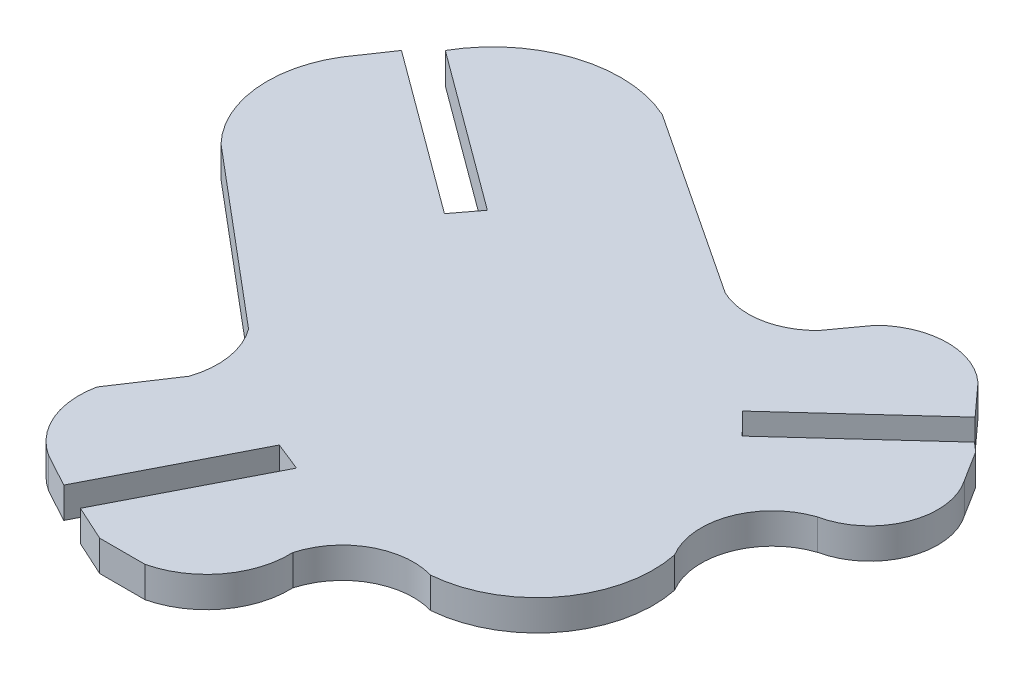
ISO-10303-21;
HEADER;
FILE_DESCRIPTION(('STEP AP214'),'2;1');
FILE_NAME('part.step','',(''),(''),'','','');
FILE_SCHEMA(('AUTOMOTIVE_DESIGN { 1 0 10303 214 1 1 1 1 }'));
ENDSEC;
DATA;
#1=APPLICATION_CONTEXT('core data for automotive mechanical design processes');
#2=APPLICATION_PROTOCOL_DEFINITION('international standard','automotive_design',2000,#1);
#3=PRODUCT_CONTEXT('',#1,'mechanical');
#4=PRODUCT('Part','Part','',(#3));
#5=PRODUCT_RELATED_PRODUCT_CATEGORY('part','',(#4));
#6=PRODUCT_DEFINITION_FORMATION('','',#4);
#7=PRODUCT_DEFINITION_CONTEXT('part definition',#1,'design');
#8=PRODUCT_DEFINITION('design','',#6,#7);
#9=PRODUCT_DEFINITION_SHAPE('','',#8);
#10=(LENGTH_UNIT() NAMED_UNIT(*) SI_UNIT(.MILLI.,.METRE.));
#11=(NAMED_UNIT(*) PLANE_ANGLE_UNIT() SI_UNIT($,.RADIAN.));
#12=(NAMED_UNIT(*) SI_UNIT($,.STERADIAN.) SOLID_ANGLE_UNIT());
#13=UNCERTAINTY_MEASURE_WITH_UNIT(LENGTH_MEASURE(1.E-05),#10,'distance_accuracy_value','');
#14=(GEOMETRIC_REPRESENTATION_CONTEXT(3) GLOBAL_UNCERTAINTY_ASSIGNED_CONTEXT((#13)) GLOBAL_UNIT_ASSIGNED_CONTEXT((#10,
#11,#12)) REPRESENTATION_CONTEXT('',''));
#15=CARTESIAN_POINT('',(0.,0.,0.));
#16=DIRECTION('',(0.,0.,1.));
#17=DIRECTION('',(1.,0.,0.));
#18=AXIS2_PLACEMENT_3D('',#15,#16,#17);
#19=CARTESIAN_POINT('',(-441.866925161714,2.,-699.134965113624));
#20=DIRECTION('',(-0.551707190438773,0.,0.834037874450649));
#21=DIRECTION('',(0.834037874450649,0.,0.551707190438773));
#22=AXIS2_PLACEMENT_3D('',#19,#20,#21);
#23=PLANE('',#22);
#24=DIRECTION('',(-0.834037874450649,0.,-0.551707190438773));
#25=VECTOR('',#24,1.);
#26=CARTESIAN_POINT('',(-441.866925161714,0.,-699.134965113624));
#27=LINE('',#26,#25);
#28=CARTESIAN_POINT('',(-307.015589999977,0.,-609.932239999967));
#29=VERTEX_POINT('',#28);
#30=CARTESIAN_POINT('',(-319.12552,0.,-617.94283));
#31=VERTEX_POINT('',#30);
#32=EDGE_CURVE('E11',#29,#31,#27,.T.);
#33=ORIENTED_EDGE('',*,*,#32,.T.);
#34=DIRECTION('',(0.,-1.,0.));
#35=VECTOR('',#34,1.);
#36=CARTESIAN_POINT('',(-319.12552,2.,-617.94283));
#37=LINE('',#36,#35);
#38=CARTESIAN_POINT('',(-319.12552,2.,-617.94283));
#39=VERTEX_POINT('',#38);
#40=EDGE_CURVE('E595',#39,#31,#37,.T.);
#41=ORIENTED_EDGE('',*,*,#40,.F.);
#42=DIRECTION('',(-0.834037874450649,0.,-0.551707190438773));
#43=VECTOR('',#42,1.);
#44=CARTESIAN_POINT('',(-441.866925161714,2.,-699.134965113624));
#45=LINE('',#44,#43);
#46=CARTESIAN_POINT('',(-307.015589999977,2.,-609.932239999967));
#47=VERTEX_POINT('',#46);
#48=EDGE_CURVE('E41',#47,#39,#45,.T.);
#49=ORIENTED_EDGE('',*,*,#48,.F.);
#50=DIRECTION('',(0.,-1.,0.));
#51=VECTOR('',#50,1.);
#52=CARTESIAN_POINT('',(-307.015589999977,2.,-609.932239999967));
#53=LINE('',#52,#51);
#54=EDGE_CURVE('E161',#47,#29,#53,.T.);
#55=ORIENTED_EDGE('',*,*,#54,.T.);
#56=EDGE_LOOP('',(#33,#41,#49,#55));
#57=FACE_BOUND('',#56,.T.);
#58=ADVANCED_FACE('F37',(#57),#23,.F.);
#59=CARTESIAN_POINT('',(-322.578964953298,2.,-610.341458400704));
#60=DIRECTION('',(0.,-1.,0.));
#61=DIRECTION('',(0.,0.,-1.));
#62=AXIS2_PLACEMENT_3D('',#59,#60,#61);
#63=CYLINDRICAL_SURFACE('',#62,8.34907972389994);
#64=CARTESIAN_POINT('',(-322.578964953298,0.,-610.341458400704));
#65=DIRECTION('',(0.,1.,0.));
#66=DIRECTION('',(0.,0.,1.));
#67=AXIS2_PLACEMENT_3D('',#64,#65,#66);
#68=CIRCLE('',#67,8.34907972389994);
#69=CARTESIAN_POINT('',(-329.825630000025,0.,-614.487900000025));
#70=VERTEX_POINT('',#69);
#71=EDGE_CURVE('E47',#31,#70,#68,.T.);
#72=ORIENTED_EDGE('',*,*,#71,.T.);
#73=DIRECTION('',(0.,-1.,0.));
#74=VECTOR('',#73,1.);
#75=CARTESIAN_POINT('',(-329.825630000025,2.,-614.487900000025));
#76=LINE('',#75,#74);
#77=CARTESIAN_POINT('',(-329.825630000025,2.,-614.487900000025));
#78=VERTEX_POINT('',#77);
#79=EDGE_CURVE('E252',#78,#70,#76,.T.);
#80=ORIENTED_EDGE('',*,*,#79,.F.);
#81=CARTESIAN_POINT('',(-322.578964953298,2.,-610.341458400704));
#82=DIRECTION('',(0.,1.,0.));
#83=DIRECTION('',(0.,0.,1.));
#84=AXIS2_PLACEMENT_3D('',#81,#82,#83);
#85=CIRCLE('',#84,8.34907972389994);
#86=EDGE_CURVE('E152',#39,#78,#85,.T.);
#87=ORIENTED_EDGE('',*,*,#86,.F.);
#88=ORIENTED_EDGE('',*,*,#40,.T.);
#89=EDGE_LOOP('',(#72,#80,#87,#88));
#90=FACE_BOUND('',#89,.T.);
#91=ADVANCED_FACE('F596',(#90),#63,.T.);
#92=CARTESIAN_POINT('',(-436.72929233314,2.,-693.204562793654));
#93=DIRECTION('',(0.592933151615653,0.,-0.805251685943674));
#94=DIRECTION('',(-0.805251685943674,0.,-0.592933151615653));
#95=AXIS2_PLACEMENT_3D('',#92,#93,#94);
#96=PLANE('',#95);
#97=DIRECTION('',(0.805251685943674,0.,0.592933151615653));
#98=VECTOR('',#97,1.);
#99=CARTESIAN_POINT('',(-436.72929233314,0.,-693.204562793654));
#100=LINE('',#99,#98);
#101=CARTESIAN_POINT('',(-319.42745,0.,-606.83138));
#102=VERTEX_POINT('',#101);
#103=EDGE_CURVE('E246',#70,#102,#100,.T.);
#104=ORIENTED_EDGE('',*,*,#103,.T.);
#105=DIRECTION('',(0.,-1.,0.));
#106=VECTOR('',#105,1.);
#107=CARTESIAN_POINT('',(-319.42745,2.,-606.83138));
#108=LINE('',#107,#106);
#109=CARTESIAN_POINT('',(-319.42745,2.,-606.83138));
#110=VERTEX_POINT('',#109);
#111=EDGE_CURVE('E250',#110,#102,#108,.T.);
#112=ORIENTED_EDGE('',*,*,#111,.F.);
#113=DIRECTION('',(0.805251685943674,0.,0.592933151615653));
#114=VECTOR('',#113,1.);
#115=CARTESIAN_POINT('',(-436.72929233314,2.,-693.204562793654));
#116=LINE('',#115,#114);
#117=EDGE_CURVE('E332',#78,#110,#116,.T.);
#118=ORIENTED_EDGE('',*,*,#117,.F.);
#119=ORIENTED_EDGE('',*,*,#79,.T.);
#120=EDGE_LOOP('',(#104,#112,#118,#119));
#121=FACE_BOUND('',#120,.T.);
#122=ADVANCED_FACE('F248',(#121),#96,.F.);
#123=CARTESIAN_POINT('',(-411.350594989002,2.,-485.431516552547));
#124=DIRECTION('',(0.797238944664529,0.,0.603663867653339));
#125=DIRECTION('',(0.603663867653339,0.,-0.797238944664529));
#126=AXIS2_PLACEMENT_3D('',#123,#124,#125);
#127=PLANE('',#126);
#128=DIRECTION('',(-0.603663867653339,0.,0.797238944664529));
#129=VECTOR('',#128,1.);
#130=CARTESIAN_POINT('',(-411.350594989002,0.,-485.431516552547));
#131=LINE('',#130,#129);
#132=CARTESIAN_POINT('',(-320.63406,0.,-605.23785));
#133=VERTEX_POINT('',#132);
#134=EDGE_CURVE('E254',#102,#133,#131,.T.);
#135=ORIENTED_EDGE('',*,*,#134,.T.);
#136=DIRECTION('',(0.,-1.,0.));
#137=VECTOR('',#136,1.);
#138=CARTESIAN_POINT('',(-320.63406,2.,-605.23785));
#139=LINE('',#138,#137);
#140=CARTESIAN_POINT('',(-320.63406,2.,-605.23785));
#141=VERTEX_POINT('',#140);
#142=EDGE_CURVE('E261',#141,#133,#139,.T.);
#143=ORIENTED_EDGE('',*,*,#142,.F.);
#144=DIRECTION('',(-0.603663867653339,0.,0.797238944664529));
#145=VECTOR('',#144,1.);
#146=CARTESIAN_POINT('',(-411.350594989002,2.,-485.431516552547));
#147=LINE('',#146,#145);
#148=EDGE_CURVE('E260',#110,#141,#147,.T.);
#149=ORIENTED_EDGE('',*,*,#148,.F.);
#150=ORIENTED_EDGE('',*,*,#111,.T.);
#151=EDGE_LOOP('',(#135,#143,#149,#150));
#152=FACE_BOUND('',#151,.T.);
#153=ADVANCED_FACE('F257',(#152),#127,.F.);
#154=CARTESIAN_POINT('',(-437.936085963276,2.,-691.592061368763));
#155=DIRECTION('',(-0.592848091817393,0.,0.805314311327246));
#156=DIRECTION('',(0.805314311327246,0.,0.592848091817393));
#157=AXIS2_PLACEMENT_3D('',#154,#155,#156);
#158=PLANE('',#157);
#159=DIRECTION('',(-0.805314311327245,0.,-0.592848091817393));
#160=VECTOR('',#159,1.);
#161=CARTESIAN_POINT('',(-437.936085963276,0.,-691.592061368763));
#162=LINE('',#161,#160);
#163=CARTESIAN_POINT('',(-331.25847,0.,-613.05922));
#164=VERTEX_POINT('',#163);
#165=EDGE_CURVE('E266',#133,#164,#162,.T.);
#166=ORIENTED_EDGE('',*,*,#165,.T.);
#167=DIRECTION('',(0.,-1.,0.));
#168=VECTOR('',#167,1.);
#169=CARTESIAN_POINT('',(-331.25847,2.,-613.05922));
#170=LINE('',#169,#168);
#171=CARTESIAN_POINT('',(-331.25847,2.,-613.05922));
#172=VERTEX_POINT('',#171);
#173=EDGE_CURVE('E406',#172,#164,#170,.T.);
#174=ORIENTED_EDGE('',*,*,#173,.F.);
#175=DIRECTION('',(-0.805314311327245,0.,-0.592848091817393));
#176=VECTOR('',#175,1.);
#177=CARTESIAN_POINT('',(-437.936085963276,2.,-691.592061368763));
#178=LINE('',#177,#176);
#179=EDGE_CURVE('E329',#141,#172,#178,.T.);
#180=ORIENTED_EDGE('',*,*,#179,.F.);
#181=ORIENTED_EDGE('',*,*,#142,.T.);
#182=EDGE_LOOP('',(#166,#174,#180,#181));
#183=FACE_BOUND('',#182,.T.);
#184=ADVANCED_FACE('F591',(#183),#158,.F.);
#185=CARTESIAN_POINT('',(-411.861982888249,2.,-494.581890618209));
#186=DIRECTION('',(0.826800158835259,0.,0.56249577540635));
#187=DIRECTION('',(0.56249577540635,0.,-0.826800158835259));
#188=AXIS2_PLACEMENT_3D('',#185,#186,#187);
#189=PLANE('',#188);
#190=DIRECTION('',(-0.56249577540635,0.,0.826800158835259));
#191=VECTOR('',#190,1.);
#192=CARTESIAN_POINT('',(-411.861982888249,0.,-494.581890618209));
#193=LINE('',#192,#191);
#194=CARTESIAN_POINT('',(-332.83373,0.,-610.74378));
#195=VERTEX_POINT('',#194);
#196=EDGE_CURVE('E268',#164,#195,#193,.T.);
#197=ORIENTED_EDGE('',*,*,#196,.T.);
#198=DIRECTION('',(0.,-1.,0.));
#199=VECTOR('',#198,1.);
#200=CARTESIAN_POINT('',(-332.83373,2.,-610.74378));
#201=LINE('',#200,#199);
#202=CARTESIAN_POINT('',(-332.83373,2.,-610.74378));
#203=VERTEX_POINT('',#202);
#204=EDGE_CURVE('E403',#203,#195,#201,.T.);
#205=ORIENTED_EDGE('',*,*,#204,.F.);
#206=DIRECTION('',(-0.56249577540635,0.,0.826800158835259));
#207=VECTOR('',#206,1.);
#208=CARTESIAN_POINT('',(-411.861982888249,2.,-494.581890618209));
#209=LINE('',#208,#207);
#210=EDGE_CURVE('E327',#172,#203,#209,.T.);
#211=ORIENTED_EDGE('',*,*,#210,.F.);
#212=ORIENTED_EDGE('',*,*,#173,.T.);
#213=EDGE_LOOP('',(#197,#205,#211,#212));
#214=FACE_BOUND('',#213,.T.);
#215=ADVANCED_FACE('F401',(#214),#189,.F.);
#216=CARTESIAN_POINT('',(-326.616839447435,2.,-606.943354947336));
#217=DIRECTION('',(0.,-1.,0.));
#218=DIRECTION('',(0.,0.,-1.));
#219=AXIS2_PLACEMENT_3D('',#216,#217,#218);
#220=CYLINDRICAL_SURFACE('',#219,7.28649152360002);
#221=CARTESIAN_POINT('',(-326.616839447435,0.,-606.943354947336));
#222=DIRECTION('',(0.,1.,0.));
#223=DIRECTION('',(0.,0.,1.));
#224=AXIS2_PLACEMENT_3D('',#221,#222,#223);
#225=CIRCLE('',#224,7.28649152360002);
#226=CARTESIAN_POINT('',(-331.865339999968,0.,-601.889029999972));
#227=VERTEX_POINT('',#226);
#228=EDGE_CURVE('E396',#195,#227,#225,.T.);
#229=ORIENTED_EDGE('',*,*,#228,.T.);
#230=DIRECTION('',(0.,-1.,0.));
#231=VECTOR('',#230,1.);
#232=CARTESIAN_POINT('',(-331.865339999968,2.,-601.889029999972));
#233=LINE('',#232,#231);
#234=CARTESIAN_POINT('',(-331.865339999968,2.,-601.889029999972));
#235=VERTEX_POINT('',#234);
#236=EDGE_CURVE('E412',#235,#227,#233,.T.);
#237=ORIENTED_EDGE('',*,*,#236,.F.);
#238=CARTESIAN_POINT('',(-326.616839447435,2.,-606.943354947336));
#239=DIRECTION('',(0.,1.,0.));
#240=DIRECTION('',(0.,0.,1.));
#241=AXIS2_PLACEMENT_3D('',#238,#239,#240);
#242=CIRCLE('',#241,7.28649152360002);
#243=EDGE_CURVE('E325',#203,#235,#242,.T.);
#244=ORIENTED_EDGE('',*,*,#243,.F.);
#245=ORIENTED_EDGE('',*,*,#204,.T.);
#246=EDGE_LOOP('',(#229,#237,#244,#245));
#247=FACE_BOUND('',#246,.T.);
#248=ADVANCED_FACE('F409',(#247),#220,.T.);
#249=CARTESIAN_POINT('',(-430.763131321581,2.,-685.134155832371));
#250=DIRECTION('',(0.643967246088412,0.,-0.765053060882254));
#251=DIRECTION('',(-0.765053060882254,0.,-0.643967246088412));
#252=AXIS2_PLACEMENT_3D('',#249,#250,#251);
#253=PLANE('',#252);
#254=DIRECTION('',(0.765053060882254,0.,0.643967246088412));
#255=VECTOR('',#254,1.);
#256=CARTESIAN_POINT('',(-430.763131321581,0.,-685.134155832371));
#257=LINE('',#256,#255);
#258=CARTESIAN_POINT('',(-320.50553,0.,-592.32715));
#259=VERTEX_POINT('',#258);
#260=EDGE_CURVE('E393',#227,#259,#257,.T.);
#261=ORIENTED_EDGE('',*,*,#260,.T.);
#262=DIRECTION('',(0.,-1.,0.));
#263=VECTOR('',#262,1.);
#264=CARTESIAN_POINT('',(-320.50553,2.,-592.32715));
#265=LINE('',#264,#263);
#266=CARTESIAN_POINT('',(-320.50553,2.,-592.32715));
#267=VERTEX_POINT('',#266);
#268=EDGE_CURVE('E421',#267,#259,#265,.T.);
#269=ORIENTED_EDGE('',*,*,#268,.F.);
#270=DIRECTION('',(0.765053060882254,0.,0.643967246088412));
#271=VECTOR('',#270,1.);
#272=CARTESIAN_POINT('',(-430.763131321581,2.,-685.134155832371));
#273=LINE('',#272,#271);
#274=EDGE_CURVE('E323',#235,#267,#273,.T.);
#275=ORIENTED_EDGE('',*,*,#274,.F.);
#276=ORIENTED_EDGE('',*,*,#236,.T.);
#277=EDGE_LOOP('',(#261,#269,#275,#276));
#278=FACE_BOUND('',#277,.T.);
#279=ADVANCED_FACE('F419',(#278),#253,.F.);
#280=CARTESIAN_POINT('',(-324.575550778408,2.,-589.322034891094));
#281=DIRECTION('',(0.,-1.,0.));
#282=DIRECTION('',(0.,0.,-1.));
#283=AXIS2_PLACEMENT_3D('',#280,#281,#282);
#284=CYLINDRICAL_SURFACE('',#283,5.05922780218982);
#285=CARTESIAN_POINT('',(-324.575550778408,0.,-589.322034891094));
#286=DIRECTION('',(0.,1.,0.));
#287=DIRECTION('',(0.,0.,1.));
#288=AXIS2_PLACEMENT_3D('',#285,#286,#287);
#289=CIRCLE('',#288,5.05922780218982);
#290=CARTESIAN_POINT('',(-319.773699999986,0.,-587.728920000001));
#291=VERTEX_POINT('',#290);
#292=EDGE_CURVE('E390',#291,#259,#289,.T.);
#293=ORIENTED_EDGE('',*,*,#292,.F.);
#294=DIRECTION('',(0.,-1.,0.));
#295=VECTOR('',#294,1.);
#296=CARTESIAN_POINT('',(-319.773699999986,2.,-587.728920000001));
#297=LINE('',#296,#295);
#298=CARTESIAN_POINT('',(-319.773699999986,2.,-587.728920000001));
#299=VERTEX_POINT('',#298);
#300=EDGE_CURVE('E423',#299,#291,#297,.T.);
#301=ORIENTED_EDGE('',*,*,#300,.F.);
#302=CARTESIAN_POINT('',(-324.575550778408,2.,-589.322034891094));
#303=DIRECTION('',(0.,1.,0.));
#304=DIRECTION('',(0.,0.,1.));
#305=AXIS2_PLACEMENT_3D('',#302,#303,#304);
#306=CIRCLE('',#305,5.05922780218982);
#307=EDGE_CURVE('E320',#299,#267,#306,.T.);
#308=ORIENTED_EDGE('',*,*,#307,.T.);
#309=ORIENTED_EDGE('',*,*,#268,.T.);
#310=EDGE_LOOP('',(#293,#301,#308,#309));
#311=FACE_BOUND('',#310,.T.);
#312=ADVANCED_FACE('F588',(#311),#284,.F.);
#313=CARTESIAN_POINT('',(-389.962390495414,2.,-481.95781333404));
#314=DIRECTION('',(0.833231438575736,0.,0.552924379792581));
#315=DIRECTION('',(0.552924379792581,0.,-0.833231438575736));
#316=AXIS2_PLACEMENT_3D('',#313,#314,#315);
#317=PLANE('',#316);
#318=DIRECTION('',(-0.552924379792581,0.,0.833231438575736));
#319=VECTOR('',#318,1.);
#320=CARTESIAN_POINT('',(-389.962390495414,0.,-481.95781333404));
#321=LINE('',#320,#319);
#322=CARTESIAN_POINT('',(-322.175300000018,0.,-584.109819999997));
#323=VERTEX_POINT('',#322);
#324=EDGE_CURVE('E388',#291,#323,#321,.T.);
#325=ORIENTED_EDGE('',*,*,#324,.T.);
#326=DIRECTION('',(0.,-1.,0.));
#327=VECTOR('',#326,1.);
#328=CARTESIAN_POINT('',(-322.175300000018,2.,-584.109819999997));
#329=LINE('',#328,#327);
#330=CARTESIAN_POINT('',(-322.175300000018,2.,-584.109819999997));
#331=VERTEX_POINT('',#330);
#332=EDGE_CURVE('E428',#331,#323,#329,.T.);
#333=ORIENTED_EDGE('',*,*,#332,.F.);
#334=DIRECTION('',(-0.552924379792581,0.,0.833231438575736));
#335=VECTOR('',#334,1.);
#336=CARTESIAN_POINT('',(-389.962390495414,2.,-481.95781333404));
#337=LINE('',#336,#335);
#338=EDGE_CURVE('E318',#299,#331,#337,.T.);
#339=ORIENTED_EDGE('',*,*,#338,.F.);
#340=ORIENTED_EDGE('',*,*,#300,.T.);
#341=EDGE_LOOP('',(#325,#333,#339,#340));
#342=FACE_BOUND('',#341,.T.);
#343=ADVANCED_FACE('F585',(#342),#317,.F.);
#344=CARTESIAN_POINT('',(-317.084902312706,2.,-583.043285507489));
#345=DIRECTION('',(0.,-1.,0.));
#346=DIRECTION('',(0.,0.,-1.));
#347=AXIS2_PLACEMENT_3D('',#344,#345,#346);
#348=CYLINDRICAL_SURFACE('',#347,5.20092726719996);
#349=CARTESIAN_POINT('',(-317.084902312706,0.,-583.043285507489));
#350=DIRECTION('',(0.,1.,0.));
#351=DIRECTION('',(0.,0.,1.));
#352=AXIS2_PLACEMENT_3D('',#349,#350,#351);
#353=CIRCLE('',#352,5.20092726719996);
#354=CARTESIAN_POINT('',(-319.88782000005,0.,-578.662270000021));
#355=VERTEX_POINT('',#354);
#356=EDGE_CURVE('E386',#323,#355,#353,.T.);
#357=ORIENTED_EDGE('',*,*,#356,.T.);
#358=DIRECTION('',(0.,-1.,0.));
#359=VECTOR('',#358,1.);
#360=CARTESIAN_POINT('',(-319.88782000005,2.,-578.662270000021));
#361=LINE('',#360,#359);
#362=CARTESIAN_POINT('',(-319.88782000005,2.,-578.662270000021));
#363=VERTEX_POINT('',#362);
#364=EDGE_CURVE('E431',#363,#355,#361,.T.);
#365=ORIENTED_EDGE('',*,*,#364,.F.);
#366=CARTESIAN_POINT('',(-317.084902312706,2.,-583.043285507489));
#367=DIRECTION('',(0.,1.,0.));
#368=DIRECTION('',(0.,0.,1.));
#369=AXIS2_PLACEMENT_3D('',#366,#367,#368);
#370=CIRCLE('',#369,5.20092726719996);
#371=EDGE_CURVE('E316',#331,#363,#370,.T.);
#372=ORIENTED_EDGE('',*,*,#371,.F.);
#373=ORIENTED_EDGE('',*,*,#332,.T.);
#374=EDGE_LOOP('',(#357,#365,#372,#373));
#375=FACE_BOUND('',#374,.T.);
#376=ADVANCED_FACE('F580',(#375),#348,.T.);
#377=CARTESIAN_POINT('',(-476.176437380374,2.,-663.591368676976));
#378=DIRECTION('',(0.47746832523969,0.,-0.878648961982432));
#379=DIRECTION('',(-0.878648961982432,0.,-0.47746832523969));
#380=AXIS2_PLACEMENT_3D('',#377,#378,#379);
#381=PLANE('',#380);
#382=DIRECTION('',(0.878648961982432,0.,0.47746832523969));
#383=VECTOR('',#382,1.);
#384=CARTESIAN_POINT('',(-476.176437380374,0.,-663.591368676976));
#385=LINE('',#384,#383);
#386=CARTESIAN_POINT('',(-317.715030000018,0.,-577.481549999997));
#387=VERTEX_POINT('',#386);
#388=EDGE_CURVE('E384',#355,#387,#385,.T.);
#389=ORIENTED_EDGE('',*,*,#388,.T.);
#390=DIRECTION('',(0.,-1.,0.));
#391=VECTOR('',#390,1.);
#392=CARTESIAN_POINT('',(-317.715030000018,2.,-577.481549999997));
#393=LINE('',#392,#391);
#394=CARTESIAN_POINT('',(-317.715030000018,2.,-577.481549999997));
#395=VERTEX_POINT('',#394);
#396=EDGE_CURVE('E434',#395,#387,#393,.T.);
#397=ORIENTED_EDGE('',*,*,#396,.F.);
#398=DIRECTION('',(0.878648961982432,0.,0.47746832523969));
#399=VECTOR('',#398,1.);
#400=CARTESIAN_POINT('',(-476.176437380374,2.,-663.591368676976));
#401=LINE('',#400,#399);
#402=EDGE_CURVE('E314',#363,#395,#401,.T.);
#403=ORIENTED_EDGE('',*,*,#402,.F.);
#404=ORIENTED_EDGE('',*,*,#364,.T.);
#405=EDGE_LOOP('',(#389,#397,#403,#404));
#406=FACE_BOUND('',#405,.T.);
#407=ADVANCED_FACE('F576',(#406),#381,.F.);
#408=CARTESIAN_POINT('',(-363.199913987513,2.,-488.754157968088));
#409=DIRECTION('',(-0.889884006191832,0.,-0.456186864699079));
#410=DIRECTION('',(-0.456186864699079,0.,0.889884006191832));
#411=AXIS2_PLACEMENT_3D('',#408,#409,#410);
#412=PLANE('',#411);
#413=DIRECTION('',(0.456186864699079,0.,-0.889884006191832));
#414=VECTOR('',#413,1.);
#415=CARTESIAN_POINT('',(-363.199913987513,0.,-488.754157968088));
#416=LINE('',#415,#414);
#417=CARTESIAN_POINT('',(-312.950060000018,0.,-586.776579999997));
#418=VERTEX_POINT('',#417);
#419=EDGE_CURVE('E382',#387,#418,#416,.T.);
#420=ORIENTED_EDGE('',*,*,#419,.T.);
#421=DIRECTION('',(0.,-1.,0.));
#422=VECTOR('',#421,1.);
#423=CARTESIAN_POINT('',(-312.950060000018,2.,-586.776579999997));
#424=LINE('',#423,#422);
#425=CARTESIAN_POINT('',(-312.950060000018,2.,-586.776579999997));
#426=VERTEX_POINT('',#425);
#427=EDGE_CURVE('E437',#426,#418,#424,.T.);
#428=ORIENTED_EDGE('',*,*,#427,.F.);
#429=DIRECTION('',(0.456186864699079,0.,-0.889884006191832));
#430=VECTOR('',#429,1.);
#431=CARTESIAN_POINT('',(-363.199913987513,2.,-488.754157968088));
#432=LINE('',#431,#430);
#433=EDGE_CURVE('E312',#395,#426,#432,.T.);
#434=ORIENTED_EDGE('',*,*,#433,.F.);
#435=ORIENTED_EDGE('',*,*,#396,.T.);
#436=EDGE_LOOP('',(#420,#428,#434,#435));
#437=FACE_BOUND('',#436,.T.);
#438=ADVANCED_FACE('F572',(#437),#412,.F.);
#439=CARTESIAN_POINT('',(-491.660908971243,2.,-657.990878278847));
#440=DIRECTION('',(0.370180269224135,0.,-0.928959939005524));
#441=DIRECTION('',(-0.928959939005524,0.,-0.370180269224135));
#442=AXIS2_PLACEMENT_3D('',#439,#440,#441);
#443=PLANE('',#442);
#444=DIRECTION('',(0.928959939005524,0.,0.370180269224135));
#445=VECTOR('',#444,1.);
#446=CARTESIAN_POINT('',(-491.660908971243,0.,-657.990878278847));
#447=LINE('',#446,#445);
#448=CARTESIAN_POINT('',(-311.083810000018,0.,-586.032899999997));
#449=VERTEX_POINT('',#448);
#450=EDGE_CURVE('E380',#418,#449,#447,.T.);
#451=ORIENTED_EDGE('',*,*,#450,.T.);
#452=DIRECTION('',(0.,-1.,0.));
#453=VECTOR('',#452,1.);
#454=CARTESIAN_POINT('',(-311.083810000018,2.,-586.032899999997));
#455=LINE('',#454,#453);
#456=CARTESIAN_POINT('',(-311.083810000018,2.,-586.032899999997));
#457=VERTEX_POINT('',#456);
#458=EDGE_CURVE('E440',#457,#449,#455,.T.);
#459=ORIENTED_EDGE('',*,*,#458,.F.);
#460=DIRECTION('',(0.928959939005524,0.,0.370180269224135));
#461=VECTOR('',#460,1.);
#462=CARTESIAN_POINT('',(-491.660908971243,2.,-657.990878278847));
#463=LINE('',#462,#461);
#464=EDGE_CURVE('E310',#426,#457,#463,.T.);
#465=ORIENTED_EDGE('',*,*,#464,.F.);
#466=ORIENTED_EDGE('',*,*,#427,.T.);
#467=EDGE_LOOP('',(#451,#459,#465,#466));
#468=FACE_BOUND('',#467,.T.);
#469=ADVANCED_FACE('F567',(#468),#443,.F.);
#470=CARTESIAN_POINT('',(-361.420151825822,2.,-487.841777467339));
#471=DIRECTION('',(0.889883984728387,0.,0.456186906567833));
#472=DIRECTION('',(0.456186906567833,0.,-0.889883984728387));
#473=AXIS2_PLACEMENT_3D('',#470,#471,#472);
#474=PLANE('',#473);
#475=DIRECTION('',(-0.456186906567833,0.,0.889883984728387));
#476=VECTOR('',#475,1.);
#477=CARTESIAN_POINT('',(-361.420151825822,0.,-487.841777467339));
#478=LINE('',#477,#476);
#479=CARTESIAN_POINT('',(-315.861740000018,0.,-576.712589999997));
#480=VERTEX_POINT('',#479);
#481=EDGE_CURVE('E378',#449,#480,#478,.T.);
#482=ORIENTED_EDGE('',*,*,#481,.T.);
#483=DIRECTION('',(0.,-1.,0.));
#484=VECTOR('',#483,1.);
#485=CARTESIAN_POINT('',(-315.861740000018,2.,-576.712589999997));
#486=LINE('',#485,#484);
#487=CARTESIAN_POINT('',(-315.861740000018,2.,-576.712589999997));
#488=VERTEX_POINT('',#487);
#489=EDGE_CURVE('E443',#488,#480,#486,.T.);
#490=ORIENTED_EDGE('',*,*,#489,.F.);
#491=DIRECTION('',(-0.456186906567833,0.,0.889883984728387));
#492=VECTOR('',#491,1.);
#493=CARTESIAN_POINT('',(-361.420151825822,2.,-487.841777467339));
#494=LINE('',#493,#492);
#495=EDGE_CURVE('E308',#457,#488,#494,.T.);
#496=ORIENTED_EDGE('',*,*,#495,.F.);
#497=ORIENTED_EDGE('',*,*,#458,.T.);
#498=EDGE_LOOP('',(#482,#490,#496,#497));
#499=FACE_BOUND('',#498,.T.);
#500=ADVANCED_FACE('F561',(#499),#474,.F.);
#501=CARTESIAN_POINT('',(-487.796944004701,2.,-655.368474344228));
#502=DIRECTION('',(0.416008815927201,0.,-0.909360580337001));
#503=DIRECTION('',(-0.909360580337001,0.,-0.416008815927201));
#504=AXIS2_PLACEMENT_3D('',#501,#502,#503);
#505=PLANE('',#504);
#506=DIRECTION('',(0.909360580337001,0.,0.416008815927201));
#507=VECTOR('',#506,1.);
#508=CARTESIAN_POINT('',(-487.796944004701,0.,-655.368474344228));
#509=LINE('',#508,#507);
#510=CARTESIAN_POINT('',(-313.545040000018,0.,-575.652759999997));
#511=VERTEX_POINT('',#510);
#512=EDGE_CURVE('E376',#480,#511,#509,.T.);
#513=ORIENTED_EDGE('',*,*,#512,.T.);
#514=DIRECTION('',(0.,-1.,0.));
#515=VECTOR('',#514,1.);
#516=CARTESIAN_POINT('',(-313.545040000018,2.,-575.652759999997));
#517=LINE('',#516,#515);
#518=CARTESIAN_POINT('',(-313.545040000018,2.,-575.652759999997));
#519=VERTEX_POINT('',#518);
#520=EDGE_CURVE('E446',#519,#511,#517,.T.);
#521=ORIENTED_EDGE('',*,*,#520,.F.);
#522=DIRECTION('',(0.909360580337001,0.,0.416008815927201));
#523=VECTOR('',#522,1.);
#524=CARTESIAN_POINT('',(-487.796944004701,2.,-655.368474344228));
#525=LINE('',#524,#523);
#526=EDGE_CURVE('E306',#488,#519,#525,.T.);
#527=ORIENTED_EDGE('',*,*,#526,.F.);
#528=ORIENTED_EDGE('',*,*,#489,.T.);
#529=EDGE_LOOP('',(#513,#521,#527,#528));
#530=FACE_BOUND('',#529,.T.);
#531=ADVANCED_FACE('F557',(#530),#505,.F.);
#532=CARTESIAN_POINT('',(-525.869702128861,2.,-575.652759999997));
#533=DIRECTION('',(0.,0.,-1.));
#534=DIRECTION('',(-1.,0.,0.));
#535=AXIS2_PLACEMENT_3D('',#532,#533,#534);
#536=PLANE('',#535);
#537=DIRECTION('',(1.,0.,0.));
#538=VECTOR('',#537,1.);
#539=CARTESIAN_POINT('',(-525.869702128861,0.,-575.652759999997));
#540=LINE('',#539,#538);
#541=CARTESIAN_POINT('',(-310.586690000018,0.,-575.652759999997));
#542=VERTEX_POINT('',#541);
#543=EDGE_CURVE('E374',#511,#542,#540,.T.);
#544=ORIENTED_EDGE('',*,*,#543,.T.);
#545=DIRECTION('',(0.,-1.,0.));
#546=VECTOR('',#545,1.);
#547=CARTESIAN_POINT('',(-310.586690000018,2.,-575.652759999997));
#548=LINE('',#547,#546);
#549=CARTESIAN_POINT('',(-310.586690000018,2.,-575.652759999997));
#550=VERTEX_POINT('',#549);
#551=EDGE_CURVE('E449',#550,#542,#548,.T.);
#552=ORIENTED_EDGE('',*,*,#551,.F.);
#553=DIRECTION('',(1.,0.,0.));
#554=VECTOR('',#553,1.);
#555=CARTESIAN_POINT('',(-525.869702128861,2.,-575.652759999997));
#556=LINE('',#555,#554);
#557=EDGE_CURVE('E304',#519,#550,#556,.T.);
#558=ORIENTED_EDGE('',*,*,#557,.F.);
#559=ORIENTED_EDGE('',*,*,#520,.T.);
#560=EDGE_LOOP('',(#544,#552,#558,#559));
#561=FACE_BOUND('',#560,.T.);
#562=ADVANCED_FACE('F552',(#561),#536,.F.);
#563=CARTESIAN_POINT('',(-311.838073974816,2.,-580.916994752258));
#564=DIRECTION('',(0.,-1.,0.));
#565=DIRECTION('',(0.,0.,-1.));
#566=AXIS2_PLACEMENT_3D('',#563,#564,#565);
#567=CYLINDRICAL_SURFACE('',#566,5.41092685029998);
#568=CARTESIAN_POINT('',(-311.838073974816,0.,-580.916994752258));
#569=DIRECTION('',(0.,1.,0.));
#570=DIRECTION('',(0.,0.,1.));
#571=AXIS2_PLACEMENT_3D('',#568,#569,#570);
#572=CIRCLE('',#571,5.41092685029998);
#573=CARTESIAN_POINT('',(-306.431680000054,0.,-581.138430000018));
#574=VERTEX_POINT('',#573);
#575=EDGE_CURVE('E371',#542,#574,#572,.T.);
#576=ORIENTED_EDGE('',*,*,#575,.T.);
#577=DIRECTION('',(0.,-1.,0.));
#578=VECTOR('',#577,1.);
#579=CARTESIAN_POINT('',(-306.431680000054,2.,-581.138430000018));
#580=LINE('',#579,#578);
#581=CARTESIAN_POINT('',(-306.431680000054,2.,-581.138430000018));
#582=VERTEX_POINT('',#581);
#583=EDGE_CURVE('E452',#582,#574,#580,.T.);
#584=ORIENTED_EDGE('',*,*,#583,.F.);
#585=CARTESIAN_POINT('',(-311.838073974816,2.,-580.916994752258));
#586=DIRECTION('',(0.,1.,0.));
#587=DIRECTION('',(0.,0.,1.));
#588=AXIS2_PLACEMENT_3D('',#585,#586,#587);
#589=CIRCLE('',#588,5.41092685029998);
#590=EDGE_CURVE('E302',#550,#582,#589,.T.);
#591=ORIENTED_EDGE('',*,*,#590,.F.);
#592=ORIENTED_EDGE('',*,*,#551,.T.);
#593=EDGE_LOOP('',(#576,#584,#591,#592));
#594=FACE_BOUND('',#593,.T.);
#595=ADVANCED_FACE('F546',(#594),#567,.T.);
#596=CARTESIAN_POINT('',(-301.955456241006,2.,-579.898386512494));
#597=DIRECTION('',(0.,-1.,0.));
#598=DIRECTION('',(0.,0.,-1.));
#599=AXIS2_PLACEMENT_3D('',#596,#597,#598);
#600=CYLINDRICAL_SURFACE('',#599,4.64481291248777);
#601=CARTESIAN_POINT('',(-301.955456241006,0.,-579.898386512494));
#602=DIRECTION('',(0.,1.,0.));
#603=DIRECTION('',(0.,0.,1.));
#604=AXIS2_PLACEMENT_3D('',#601,#602,#603);
#605=CIRCLE('',#604,4.64481291248777);
#606=CARTESIAN_POINT('',(-300.665630000047,0.,-584.36051999998));
#607=VERTEX_POINT('',#606);
#608=EDGE_CURVE('E368',#607,#574,#605,.T.);
#609=ORIENTED_EDGE('',*,*,#608,.F.);
#610=DIRECTION('',(0.,-1.,0.));
#611=VECTOR('',#610,1.);
#612=CARTESIAN_POINT('',(-300.665630000047,2.,-584.36051999998));
#613=LINE('',#612,#611);
#614=CARTESIAN_POINT('',(-300.665630000047,2.,-584.36051999998));
#615=VERTEX_POINT('',#614);
#616=EDGE_CURVE('E454',#615,#607,#613,.T.);
#617=ORIENTED_EDGE('',*,*,#616,.F.);
#618=CARTESIAN_POINT('',(-301.955456241006,2.,-579.898386512494));
#619=DIRECTION('',(0.,1.,0.));
#620=DIRECTION('',(0.,0.,1.));
#621=AXIS2_PLACEMENT_3D('',#618,#619,#620);
#622=CIRCLE('',#621,4.64481291248777);
#623=EDGE_CURVE('E299',#615,#582,#622,.T.);
#624=ORIENTED_EDGE('',*,*,#623,.T.);
#625=ORIENTED_EDGE('',*,*,#583,.T.);
#626=EDGE_LOOP('',(#609,#617,#624,#625));
#627=FACE_BOUND('',#626,.T.);
#628=ADVANCED_FACE('F540',(#627),#600,.F.);
#629=CARTESIAN_POINT('',(-301.279080957897,2.,-591.929168721821));
#630=DIRECTION('',(0.,-1.,0.));
#631=DIRECTION('',(0.,0.,-1.));
#632=AXIS2_PLACEMENT_3D('',#629,#630,#631);
#633=CYLINDRICAL_SURFACE('',#632,7.59346861139997);
#634=CARTESIAN_POINT('',(-301.279080957897,0.,-591.929168721821));
#635=DIRECTION('',(0.,1.,0.));
#636=DIRECTION('',(0.,0.,1.));
#637=AXIS2_PLACEMENT_3D('',#634,#635,#636);
#638=CIRCLE('',#637,7.59346861139997);
#639=CARTESIAN_POINT('',(-293.842540000045,0.,-593.464950000033));
#640=VERTEX_POINT('',#639);
#641=EDGE_CURVE('E365',#607,#640,#638,.T.);
#642=ORIENTED_EDGE('',*,*,#641,.T.);
#643=DIRECTION('',(0.,-1.,0.));
#644=VECTOR('',#643,1.);
#645=CARTESIAN_POINT('',(-293.842540000045,2.,-593.464950000033));
#646=LINE('',#645,#644);
#647=CARTESIAN_POINT('',(-293.842540000045,2.,-593.464950000033));
#648=VERTEX_POINT('',#647);
#649=EDGE_CURVE('E456',#648,#640,#646,.T.);
#650=ORIENTED_EDGE('',*,*,#649,.F.);
#651=CARTESIAN_POINT('',(-301.279080957897,2.,-591.929168721821));
#652=DIRECTION('',(0.,1.,0.));
#653=DIRECTION('',(0.,0.,1.));
#654=AXIS2_PLACEMENT_3D('',#651,#652,#653);
#655=CIRCLE('',#654,7.59346861139997);
#656=EDGE_CURVE('E297',#615,#648,#655,.T.);
#657=ORIENTED_EDGE('',*,*,#656,.F.);
#658=ORIENTED_EDGE('',*,*,#616,.T.);
#659=EDGE_LOOP('',(#642,#650,#657,#658));
#660=FACE_BOUND('',#659,.T.);
#661=ADVANCED_FACE('F638',(#660),#633,.T.);
#662=CARTESIAN_POINT('',(-289.858317150217,2.,-595.860527710339));
#663=DIRECTION('',(0.,-1.,0.));
#664=DIRECTION('',(0.,0.,-1.));
#665=AXIS2_PLACEMENT_3D('',#662,#663,#664);
#666=CYLINDRICAL_SURFACE('',#665,4.64895948392845);
#667=CARTESIAN_POINT('',(-289.858317150217,0.,-595.860527710339));
#668=DIRECTION('',(0.,1.,0.));
#669=DIRECTION('',(0.,0.,1.));
#670=AXIS2_PLACEMENT_3D('',#667,#668,#669);
#671=CIRCLE('',#670,4.64895948392845);
#672=CARTESIAN_POINT('',(-291.326819999983,0.,-600.271459999939));
#673=VERTEX_POINT('',#672);
#674=EDGE_CURVE('E362',#673,#640,#671,.T.);
#675=ORIENTED_EDGE('',*,*,#674,.F.);
#676=DIRECTION('',(0.,-1.,0.));
#677=VECTOR('',#676,1.);
#678=CARTESIAN_POINT('',(-291.326819999983,2.,-600.271459999939));
#679=LINE('',#678,#677);
#680=CARTESIAN_POINT('',(-291.326819999983,2.,-600.271459999939));
#681=VERTEX_POINT('',#680);
#682=EDGE_CURVE('E458',#681,#673,#679,.T.);
#683=ORIENTED_EDGE('',*,*,#682,.F.);
#684=CARTESIAN_POINT('',(-289.858317150217,2.,-595.860527710339));
#685=DIRECTION('',(0.,1.,0.));
#686=DIRECTION('',(0.,0.,1.));
#687=AXIS2_PLACEMENT_3D('',#684,#685,#686);
#688=CIRCLE('',#687,4.64895948392845);
#689=EDGE_CURVE('E294',#681,#648,#688,.T.);
#690=ORIENTED_EDGE('',*,*,#689,.T.);
#691=ORIENTED_EDGE('',*,*,#649,.T.);
#692=EDGE_LOOP('',(#675,#683,#690,#691));
#693=FACE_BOUND('',#692,.T.);
#694=ADVANCED_FACE('F533',(#693),#666,.F.);
#695=CARTESIAN_POINT('',(-292.243461194285,2.,-604.61018695776));
#696=DIRECTION('',(0.,-1.,0.));
#697=DIRECTION('',(0.,0.,-1.));
#698=AXIS2_PLACEMENT_3D('',#695,#696,#697);
#699=CYLINDRICAL_SURFACE('',#698,4.43449914799998);
#700=CARTESIAN_POINT('',(-292.243461194285,0.,-604.61018695776));
#701=DIRECTION('',(0.,1.,0.));
#702=DIRECTION('',(0.,0.,1.));
#703=AXIS2_PLACEMENT_3D('',#700,#701,#702);
#704=CIRCLE('',#703,4.43449914799998);
#705=CARTESIAN_POINT('',(-288.619969999995,0.,-607.166569999974));
#706=VERTEX_POINT('',#705);
#707=EDGE_CURVE('E360',#673,#706,#704,.T.);
#708=ORIENTED_EDGE('',*,*,#707,.T.);
#709=DIRECTION('',(0.,-1.,0.));
#710=VECTOR('',#709,1.);
#711=CARTESIAN_POINT('',(-288.619969999995,2.,-607.166569999974));
#712=LINE('',#711,#710);
#713=CARTESIAN_POINT('',(-288.619969999995,2.,-607.166569999974));
#714=VERTEX_POINT('',#713);
#715=EDGE_CURVE('E460',#714,#706,#712,.T.);
#716=ORIENTED_EDGE('',*,*,#715,.F.);
#717=CARTESIAN_POINT('',(-292.243461194285,2.,-604.61018695776));
#718=DIRECTION('',(0.,1.,0.));
#719=DIRECTION('',(0.,0.,1.));
#720=AXIS2_PLACEMENT_3D('',#717,#718,#719);
#721=CIRCLE('',#720,4.43449914799998);
#722=EDGE_CURVE('E292',#681,#714,#721,.T.);
#723=ORIENTED_EDGE('',*,*,#722,.F.);
#724=ORIENTED_EDGE('',*,*,#682,.T.);
#725=EDGE_LOOP('',(#708,#716,#723,#724));
#726=FACE_BOUND('',#725,.T.);
#727=ADVANCED_FACE('F530',(#726),#699,.T.);
#728=CARTESIAN_POINT('',(-339.937149863531,2.,-688.893525439902));
#729=DIRECTION('',(-0.846888801852325,0.,0.531770022939554));
#730=DIRECTION('',(0.531770022939554,0.,0.846888801852325));
#731=AXIS2_PLACEMENT_3D('',#728,#729,#730);
#732=PLANE('',#731);
#733=DIRECTION('',(-0.531770022939554,0.,-0.846888801852325));
#734=VECTOR('',#733,1.);
#735=CARTESIAN_POINT('',(-339.937149863531,0.,-688.893525439902));
#736=LINE('',#735,#734);
#737=CARTESIAN_POINT('',(-289.839879999996,0.,-609.109379999976));
#738=VERTEX_POINT('',#737);
#739=EDGE_CURVE('E358',#706,#738,#736,.T.);
#740=ORIENTED_EDGE('',*,*,#739,.T.);
#741=DIRECTION('',(0.,-1.,0.));
#742=VECTOR('',#741,1.);
#743=CARTESIAN_POINT('',(-289.839879999996,2.,-609.109379999976));
#744=LINE('',#743,#742);
#745=CARTESIAN_POINT('',(-289.839879999996,2.,-609.109379999976));
#746=VERTEX_POINT('',#745);
#747=EDGE_CURVE('E463',#746,#738,#744,.T.);
#748=ORIENTED_EDGE('',*,*,#747,.F.);
#749=DIRECTION('',(-0.531770022939554,0.,-0.846888801852325));
#750=VECTOR('',#749,1.);
#751=CARTESIAN_POINT('',(-339.937149863531,2.,-688.893525439902));
#752=LINE('',#751,#750);
#753=EDGE_CURVE('E290',#714,#746,#752,.T.);
#754=ORIENTED_EDGE('',*,*,#753,.F.);
#755=ORIENTED_EDGE('',*,*,#715,.T.);
#756=EDGE_LOOP('',(#740,#748,#754,#755));
#757=FACE_BOUND('',#756,.T.);
#758=ADVANCED_FACE('F525',(#757),#732,.F.);
#759=CARTESIAN_POINT('',(-407.66185607815,2.,-710.080247593696));
#760=DIRECTION('',(-0.650719305735664,0.,0.759318368764312));
#761=DIRECTION('',(0.759318368764312,0.,0.650719305735664));
#762=AXIS2_PLACEMENT_3D('',#759,#760,#761);
#763=PLANE('',#762);
#764=DIRECTION('',(-0.759318368764312,0.,-0.650719305735664));
#765=VECTOR('',#764,1.);
#766=CARTESIAN_POINT('',(-407.66185607815,0.,-710.080247593696));
#767=LINE('',#766,#765);
#768=CARTESIAN_POINT('',(-290.429929999996,0.,-609.615039999976));
#769=VERTEX_POINT('',#768);
#770=EDGE_CURVE('E356',#738,#769,#767,.T.);
#771=ORIENTED_EDGE('',*,*,#770,.T.);
#772=DIRECTION('',(0.,-1.,0.));
#773=VECTOR('',#772,1.);
#774=CARTESIAN_POINT('',(-290.429929999996,2.,-609.615039999976));
#775=LINE('',#774,#773);
#776=CARTESIAN_POINT('',(-290.429929999996,2.,-609.615039999976));
#777=VERTEX_POINT('',#776);
#778=EDGE_CURVE('E466',#777,#769,#775,.T.);
#779=ORIENTED_EDGE('',*,*,#778,.F.);
#780=DIRECTION('',(-0.759318368764312,0.,-0.650719305735664));
#781=VECTOR('',#780,1.);
#782=CARTESIAN_POINT('',(-407.66185607815,2.,-710.080247593696));
#783=LINE('',#782,#781);
#784=EDGE_CURVE('E288',#746,#777,#783,.T.);
#785=ORIENTED_EDGE('',*,*,#784,.F.);
#786=ORIENTED_EDGE('',*,*,#747,.T.);
#787=EDGE_LOOP('',(#771,#779,#785,#786));
#788=FACE_BOUND('',#787,.T.);
#789=ADVANCED_FACE('F519',(#788),#763,.F.);
#790=CARTESIAN_POINT('',(-437.511907063186,2.,-475.351262250609));
#791=DIRECTION('',(0.674191417390389,0.,0.73855665504898));
#792=DIRECTION('',(0.73855665504898,0.,-0.674191417390389));
#793=AXIS2_PLACEMENT_3D('',#790,#791,#792);
#794=PLANE('',#793);
#795=DIRECTION('',(-0.73855665504898,0.,0.674191417390389));
#796=VECTOR('',#795,1.);
#797=CARTESIAN_POINT('',(-437.511907063186,0.,-475.351262250609));
#798=LINE('',#797,#796);
#799=CARTESIAN_POINT('',(-298.352129999996,0.,-602.383259999976));
#800=VERTEX_POINT('',#799);
#801=EDGE_CURVE('E354',#769,#800,#798,.T.);
#802=ORIENTED_EDGE('',*,*,#801,.T.);
#803=DIRECTION('',(0.,-1.,0.));
#804=VECTOR('',#803,1.);
#805=CARTESIAN_POINT('',(-298.352129999996,2.,-602.383259999976));
#806=LINE('',#805,#804);
#807=CARTESIAN_POINT('',(-298.352129999996,2.,-602.383259999976));
#808=VERTEX_POINT('',#807);
#809=EDGE_CURVE('E469',#808,#800,#806,.T.);
#810=ORIENTED_EDGE('',*,*,#809,.F.);
#811=DIRECTION('',(-0.73855665504898,0.,0.674191417390389));
#812=VECTOR('',#811,1.);
#813=CARTESIAN_POINT('',(-437.511907063186,2.,-475.351262250609));
#814=LINE('',#813,#812);
#815=EDGE_CURVE('E286',#777,#808,#814,.T.);
#816=ORIENTED_EDGE('',*,*,#815,.F.);
#817=ORIENTED_EDGE('',*,*,#778,.T.);
#818=EDGE_LOOP('',(#802,#810,#816,#817));
#819=FACE_BOUND('',#818,.T.);
#820=ADVANCED_FACE('F515',(#819),#794,.F.);
#821=CARTESIAN_POINT('',(-394.40542590842,2.,-700.648987061478));
#822=DIRECTION('',(-0.715111240015697,0.,0.699010668304291));
#823=DIRECTION('',(0.699010668304291,0.,0.715111240015697));
#824=AXIS2_PLACEMENT_3D('',#821,#822,#823);
#825=PLANE('',#824);
#826=DIRECTION('',(-0.699010668304291,0.,-0.715111240015697));
#827=VECTOR('',#826,1.);
#828=CARTESIAN_POINT('',(-394.40542590842,0.,-700.648987061478));
#829=LINE('',#828,#827);
#830=CARTESIAN_POINT('',(-299.750969999996,0.,-603.814319999976));
#831=VERTEX_POINT('',#830);
#832=EDGE_CURVE('E352',#800,#831,#829,.T.);
#833=ORIENTED_EDGE('',*,*,#832,.T.);
#834=DIRECTION('',(0.,-1.,0.));
#835=VECTOR('',#834,1.);
#836=CARTESIAN_POINT('',(-299.750969999996,2.,-603.814319999976));
#837=LINE('',#836,#835);
#838=CARTESIAN_POINT('',(-299.750969999996,2.,-603.814319999976));
#839=VERTEX_POINT('',#838);
#840=EDGE_CURVE('E472',#839,#831,#837,.T.);
#841=ORIENTED_EDGE('',*,*,#840,.F.);
#842=DIRECTION('',(-0.699010668304291,0.,-0.715111240015697));
#843=VECTOR('',#842,1.);
#844=CARTESIAN_POINT('',(-394.40542590842,2.,-700.648987061478));
#845=LINE('',#844,#843);
#846=EDGE_CURVE('E284',#808,#839,#845,.T.);
#847=ORIENTED_EDGE('',*,*,#846,.F.);
#848=ORIENTED_EDGE('',*,*,#809,.T.);
#849=EDGE_LOOP('',(#833,#841,#847,#848));
#850=FACE_BOUND('',#849,.T.);
#851=ADVANCED_FACE('F510',(#850),#825,.F.);
#852=CARTESIAN_POINT('',(-438.860426333415,2.,-476.828410328434));
#853=DIRECTION('',(-0.674190974881096,0.,-0.73855705899333));
#854=DIRECTION('',(-0.73855705899333,0.,0.674190974881096));
#855=AXIS2_PLACEMENT_3D('',#852,#853,#854);
#856=PLANE('',#855);
#857=DIRECTION('',(0.73855705899333,0.,-0.674190974881096));
#858=VECTOR('',#857,1.);
#859=CARTESIAN_POINT('',(-438.860426333415,0.,-476.828410328434));
#860=LINE('',#859,#858);
#861=CARTESIAN_POINT('',(-291.822099999996,0.,-611.052179999976));
#862=VERTEX_POINT('',#861);
#863=EDGE_CURVE('E350',#831,#862,#860,.T.);
#864=ORIENTED_EDGE('',*,*,#863,.T.);
#865=DIRECTION('',(0.,-1.,0.));
#866=VECTOR('',#865,1.);
#867=CARTESIAN_POINT('',(-291.822099999996,2.,-611.052179999976));
#868=LINE('',#867,#866);
#869=CARTESIAN_POINT('',(-291.822099999996,2.,-611.052179999976));
#870=VERTEX_POINT('',#869);
#871=EDGE_CURVE('E475',#870,#862,#868,.T.);
#872=ORIENTED_EDGE('',*,*,#871,.F.);
#873=DIRECTION('',(0.73855705899333,0.,-0.674190974881096));
#874=VECTOR('',#873,1.);
#875=CARTESIAN_POINT('',(-438.860426333415,2.,-476.828410328434));
#876=LINE('',#875,#874);
#877=EDGE_CURVE('E282',#839,#870,#876,.T.);
#878=ORIENTED_EDGE('',*,*,#877,.F.);
#879=ORIENTED_EDGE('',*,*,#840,.T.);
#880=EDGE_LOOP('',(#864,#872,#878,#879));
#881=FACE_BOUND('',#880,.T.);
#882=ADVANCED_FACE('F504',(#881),#856,.F.);
#883=CARTESIAN_POINT('',(-378.234194304138,2.,-706.210533205469));
#884=DIRECTION('',(-0.740309762644833,0.,0.672265911178569));
#885=DIRECTION('',(0.672265911178569,0.,0.740309762644833));
#886=AXIS2_PLACEMENT_3D('',#883,#884,#885);
#887=PLANE('',#886);
#888=DIRECTION('',(-0.672265911178569,0.,-0.740309762644833));
#889=VECTOR('',#888,1.);
#890=CARTESIAN_POINT('',(-378.234194304138,0.,-706.210533205469));
#891=LINE('',#890,#889);
#892=CARTESIAN_POINT('',(-293.690189999996,0.,-613.109349999976));
#893=VERTEX_POINT('',#892);
#894=EDGE_CURVE('E348',#862,#893,#891,.T.);
#895=ORIENTED_EDGE('',*,*,#894,.T.);
#896=DIRECTION('',(0.,-1.,0.));
#897=VECTOR('',#896,1.);
#898=CARTESIAN_POINT('',(-293.690189999996,2.,-613.109349999976));
#899=LINE('',#898,#897);
#900=CARTESIAN_POINT('',(-293.690189999996,2.,-613.109349999976));
#901=VERTEX_POINT('',#900);
#902=EDGE_CURVE('E478',#901,#893,#899,.T.);
#903=ORIENTED_EDGE('',*,*,#902,.F.);
#904=DIRECTION('',(-0.672265911178569,0.,-0.740309762644833));
#905=VECTOR('',#904,1.);
#906=CARTESIAN_POINT('',(-378.234194304138,2.,-706.210533205469));
#907=LINE('',#906,#905);
#908=EDGE_CURVE('E280',#870,#901,#907,.T.);
#909=ORIENTED_EDGE('',*,*,#908,.F.);
#910=ORIENTED_EDGE('',*,*,#871,.T.);
#911=EDGE_LOOP('',(#895,#903,#909,#910));
#912=FACE_BOUND('',#911,.T.);
#913=ADVANCED_FACE('F500',(#912),#887,.F.);
#914=CARTESIAN_POINT('',(-296.917458034478,2.,-609.566910030393));
#915=DIRECTION('',(0.,-1.,0.));
#916=DIRECTION('',(0.,0.,-1.));
#917=AXIS2_PLACEMENT_3D('',#914,#915,#916);
#918=CYLINDRICAL_SURFACE('',#917,4.79209139150009);
#919=CARTESIAN_POINT('',(-296.917458034478,0.,-609.566910030393));
#920=DIRECTION('',(0.,1.,0.));
#921=DIRECTION('',(0.,0.,1.));
#922=AXIS2_PLACEMENT_3D('',#919,#920,#921);
#923=CIRCLE('',#922,4.79209139150009);
#924=CARTESIAN_POINT('',(-300.252900000033,0.,-613.00768999995));
#925=VERTEX_POINT('',#924);
#926=EDGE_CURVE('E342',#893,#925,#923,.T.);
#927=ORIENTED_EDGE('',*,*,#926,.T.);
#928=DIRECTION('',(0.,-1.,0.));
#929=VECTOR('',#928,1.);
#930=CARTESIAN_POINT('',(-300.252900000033,2.,-613.00768999995));
#931=LINE('',#930,#929);
#932=CARTESIAN_POINT('',(-300.252900000033,2.,-613.00768999995));
#933=VERTEX_POINT('',#932);
#934=EDGE_CURVE('E481',#933,#925,#931,.T.);
#935=ORIENTED_EDGE('',*,*,#934,.F.);
#936=CARTESIAN_POINT('',(-296.917458034478,2.,-609.566910030393));
#937=DIRECTION('',(0.,1.,0.));
#938=DIRECTION('',(0.,0.,1.));
#939=AXIS2_PLACEMENT_3D('',#936,#937,#938);
#940=CIRCLE('',#939,4.79209139150009);
#941=EDGE_CURVE('E278',#901,#933,#940,.T.);
#942=ORIENTED_EDGE('',*,*,#941,.F.);
#943=ORIENTED_EDGE('',*,*,#902,.T.);
#944=EDGE_LOOP('',(#927,#935,#942,#943));
#945=FACE_BOUND('',#944,.T.);
#946=ADVANCED_FACE('F495',(#945),#918,.T.);
#947=CARTESIAN_POINT('',(-397.459824528179,2.,-478.998958418849));
#948=DIRECTION('',(0.809465188913536,0.,0.587167870320894));
#949=DIRECTION('',(0.587167870320894,0.,-0.809465188913536));
#950=AXIS2_PLACEMENT_3D('',#947,#948,#949);
#951=PLANE('',#950);
#952=DIRECTION('',(-0.587167870320894,0.,0.809465188913536));
#953=VECTOR('',#952,1.);
#954=CARTESIAN_POINT('',(-397.459824528179,0.,-478.998958418849));
#955=LINE('',#954,#953);
#956=CARTESIAN_POINT('',(-301.809639999996,0.,-610.861579999976));
#957=VERTEX_POINT('',#956);
#958=EDGE_CURVE('E337',#925,#957,#955,.T.);
#959=ORIENTED_EDGE('',*,*,#958,.T.);
#960=DIRECTION('',(0.,-1.,0.));
#961=VECTOR('',#960,1.);
#962=CARTESIAN_POINT('',(-301.809639999996,2.,-610.861579999976));
#963=LINE('',#962,#961);
#964=CARTESIAN_POINT('',(-301.809639999996,2.,-610.861579999976));
#965=VERTEX_POINT('',#964);
#966=EDGE_CURVE('E483',#965,#957,#963,.T.);
#967=ORIENTED_EDGE('',*,*,#966,.F.);
#968=DIRECTION('',(-0.587167870320894,0.,0.809465188913536));
#969=VECTOR('',#968,1.);
#970=CARTESIAN_POINT('',(-397.459824528179,2.,-478.998958418849));
#971=LINE('',#970,#969);
#972=EDGE_CURVE('E276',#933,#965,#971,.T.);
#973=ORIENTED_EDGE('',*,*,#972,.F.);
#974=ORIENTED_EDGE('',*,*,#934,.T.);
#975=EDGE_LOOP('',(#959,#967,#973,#974));
#976=FACE_BOUND('',#975,.T.);
#977=ADVANCED_FACE('F489',(#976),#951,.F.);
#978=CARTESIAN_POINT('',(-305.049634801007,2.,-613.965349142887));
#979=DIRECTION('',(0.,-1.,0.));
#980=DIRECTION('',(0.,0.,-1.));
#981=AXIS2_PLACEMENT_3D('',#978,#979,#980);
#982=CYLINDRICAL_SURFACE('',#981,4.48675263448509);
#983=CARTESIAN_POINT('',(-305.049634801007,0.,-613.965349142887));
#984=DIRECTION('',(0.,1.,0.));
#985=DIRECTION('',(0.,0.,1.));
#986=AXIS2_PLACEMENT_3D('',#983,#984,#985);
#987=CIRCLE('',#986,4.48675263448509);
#988=EDGE_CURVE('E333',#29,#957,#987,.T.);
#989=ORIENTED_EDGE('',*,*,#988,.F.);
#990=ORIENTED_EDGE('',*,*,#54,.F.);
#991=CARTESIAN_POINT('',(-305.049634801007,2.,-613.965349142887));
#992=DIRECTION('',(0.,1.,0.));
#993=DIRECTION('',(0.,0.,1.));
#994=AXIS2_PLACEMENT_3D('',#991,#992,#993);
#995=CIRCLE('',#994,4.48675263448509);
#996=EDGE_CURVE('E273',#47,#965,#995,.T.);
#997=ORIENTED_EDGE('',*,*,#996,.T.);
#998=ORIENTED_EDGE('',*,*,#966,.T.);
#999=EDGE_LOOP('',(#989,#990,#997,#998));
#1000=FACE_BOUND('',#999,.T.);
#1001=ADVANCED_FACE('F486',(#1000),#982,.F.);
#1002=CARTESIAN_POINT('',(-525.869702128861,2.,-572.1446));
#1003=DIRECTION('',(0.,1.,0.));
#1004=DIRECTION('',(0.,0.,1.));
#1005=AXIS2_PLACEMENT_3D('',#1002,#1003,#1004);
#1006=PLANE('',#1005);
#1007=ORIENTED_EDGE('',*,*,#48,.T.);
#1008=ORIENTED_EDGE('',*,*,#86,.T.);
#1009=ORIENTED_EDGE('',*,*,#117,.T.);
#1010=ORIENTED_EDGE('',*,*,#148,.T.);
#1011=ORIENTED_EDGE('',*,*,#179,.T.);
#1012=ORIENTED_EDGE('',*,*,#210,.T.);
#1013=ORIENTED_EDGE('',*,*,#243,.T.);
#1014=ORIENTED_EDGE('',*,*,#274,.T.);
#1015=ORIENTED_EDGE('',*,*,#307,.F.);
#1016=ORIENTED_EDGE('',*,*,#338,.T.);
#1017=ORIENTED_EDGE('',*,*,#371,.T.);
#1018=ORIENTED_EDGE('',*,*,#402,.T.);
#1019=ORIENTED_EDGE('',*,*,#433,.T.);
#1020=ORIENTED_EDGE('',*,*,#464,.T.);
#1021=ORIENTED_EDGE('',*,*,#495,.T.);
#1022=ORIENTED_EDGE('',*,*,#526,.T.);
#1023=ORIENTED_EDGE('',*,*,#557,.T.);
#1024=ORIENTED_EDGE('',*,*,#590,.T.);
#1025=ORIENTED_EDGE('',*,*,#623,.F.);
#1026=ORIENTED_EDGE('',*,*,#656,.T.);
#1027=ORIENTED_EDGE('',*,*,#689,.F.);
#1028=ORIENTED_EDGE('',*,*,#722,.T.);
#1029=ORIENTED_EDGE('',*,*,#753,.T.);
#1030=ORIENTED_EDGE('',*,*,#784,.T.);
#1031=ORIENTED_EDGE('',*,*,#815,.T.);
#1032=ORIENTED_EDGE('',*,*,#846,.T.);
#1033=ORIENTED_EDGE('',*,*,#877,.T.);
#1034=ORIENTED_EDGE('',*,*,#908,.T.);
#1035=ORIENTED_EDGE('',*,*,#941,.T.);
#1036=ORIENTED_EDGE('',*,*,#972,.T.);
#1037=ORIENTED_EDGE('',*,*,#996,.F.);
#1038=EDGE_LOOP('',(#1007,#1008,#1009,#1010,#1011,#1012,#1013,#1014,#1015,#1016,#1017,#1018,
#1019,#1020,#1021,#1022,#1023,#1024,#1025,#1026,#1027,#1028,#1029,#1030,#1031,#1032,#1033,#1034,
#1035,#1036,#1037));
#1039=FACE_BOUND('',#1038,.T.);
#1040=ADVANCED_FACE('F39',(#1039),#1006,.T.);
#1041=CARTESIAN_POINT('',(-525.869702128861,0.,-572.1446));
#1042=DIRECTION('',(0.,1.,0.));
#1043=DIRECTION('',(0.,0.,1.));
#1044=AXIS2_PLACEMENT_3D('',#1041,#1042,#1043);
#1045=PLANE('',#1044);
#1046=ORIENTED_EDGE('',*,*,#32,.F.);
#1047=ORIENTED_EDGE('',*,*,#988,.T.);
#1048=ORIENTED_EDGE('',*,*,#958,.F.);
#1049=ORIENTED_EDGE('',*,*,#926,.F.);
#1050=ORIENTED_EDGE('',*,*,#894,.F.);
#1051=ORIENTED_EDGE('',*,*,#863,.F.);
#1052=ORIENTED_EDGE('',*,*,#832,.F.);
#1053=ORIENTED_EDGE('',*,*,#801,.F.);
#1054=ORIENTED_EDGE('',*,*,#770,.F.);
#1055=ORIENTED_EDGE('',*,*,#739,.F.);
#1056=ORIENTED_EDGE('',*,*,#707,.F.);
#1057=ORIENTED_EDGE('',*,*,#674,.T.);
#1058=ORIENTED_EDGE('',*,*,#641,.F.);
#1059=ORIENTED_EDGE('',*,*,#608,.T.);
#1060=ORIENTED_EDGE('',*,*,#575,.F.);
#1061=ORIENTED_EDGE('',*,*,#543,.F.);
#1062=ORIENTED_EDGE('',*,*,#512,.F.);
#1063=ORIENTED_EDGE('',*,*,#481,.F.);
#1064=ORIENTED_EDGE('',*,*,#450,.F.);
#1065=ORIENTED_EDGE('',*,*,#419,.F.);
#1066=ORIENTED_EDGE('',*,*,#388,.F.);
#1067=ORIENTED_EDGE('',*,*,#356,.F.);
#1068=ORIENTED_EDGE('',*,*,#324,.F.);
#1069=ORIENTED_EDGE('',*,*,#292,.T.);
#1070=ORIENTED_EDGE('',*,*,#260,.F.);
#1071=ORIENTED_EDGE('',*,*,#228,.F.);
#1072=ORIENTED_EDGE('',*,*,#196,.F.);
#1073=ORIENTED_EDGE('',*,*,#165,.F.);
#1074=ORIENTED_EDGE('',*,*,#134,.F.);
#1075=ORIENTED_EDGE('',*,*,#103,.F.);
#1076=ORIENTED_EDGE('',*,*,#71,.F.);
#1077=EDGE_LOOP('',(#1046,#1047,#1048,#1049,#1050,#1051,#1052,#1053,#1054,#1055,#1056,#1057,
#1058,#1059,#1060,#1061,#1062,#1063,#1064,#1065,#1066,#1067,#1068,#1069,#1070,#1071,#1072,#1073,
#1074,#1075,#1076));
#1078=FACE_BOUND('',#1077,.T.);
#1079=ADVANCED_FACE('F264',(#1078),#1045,.F.);
#1080=CLOSED_SHELL('',(#58,#91,#122,#153,#184,#215,#248,#279,#312,#343,#376,#407,#438,#469,#500,
#531,#562,#595,#628,#661,#694,#727,#758,#789,#820,#851,#882,#913,#946,#977,#1001,#1040,#1079));
#1081=MANIFOLD_SOLID_BREP('B2',#1080);
#1082=ADVANCED_BREP_SHAPE_REPRESENTATION('',(#18,#1081),#14);
#1083=SHAPE_DEFINITION_REPRESENTATION(#9,#1082);
ENDSEC;
END-ISO-10303-21;
